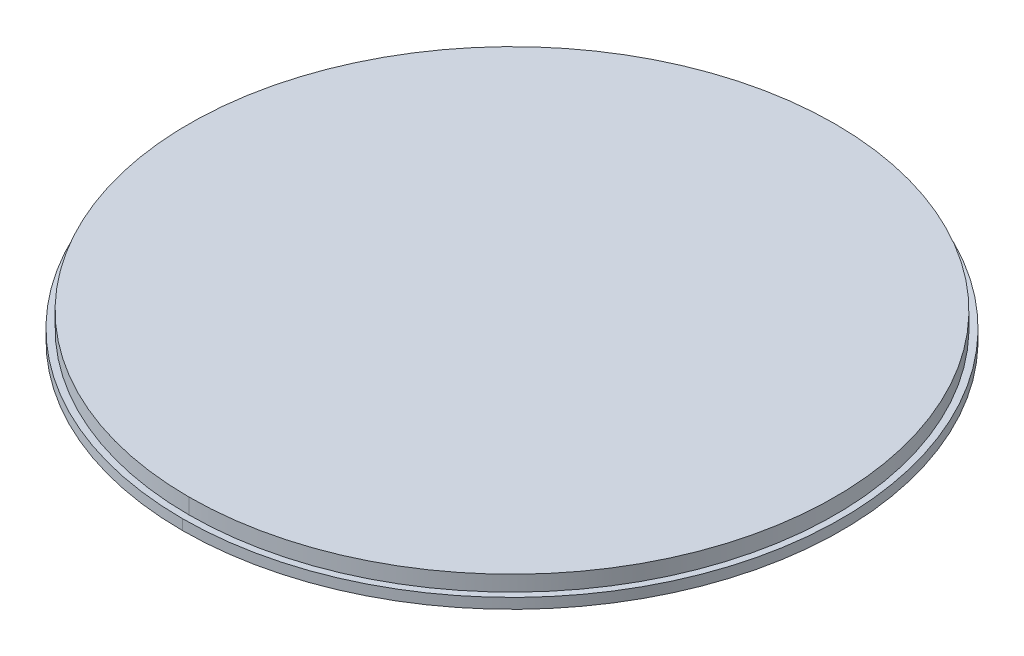
ISO-10303-21;
HEADER;
FILE_DESCRIPTION(('STEP AP214'),'2;1');
FILE_NAME('part.step','',(''),(''),'','','');
FILE_SCHEMA(('AUTOMOTIVE_DESIGN { 1 0 10303 214 1 1 1 1 }'));
ENDSEC;
DATA;
#1=APPLICATION_CONTEXT('core data for automotive mechanical design processes');
#2=APPLICATION_PROTOCOL_DEFINITION('international standard','automotive_design',2000,#1);
#3=PRODUCT_CONTEXT('',#1,'mechanical');
#4=PRODUCT('Part','Part','',(#3));
#5=PRODUCT_RELATED_PRODUCT_CATEGORY('part','',(#4));
#6=PRODUCT_DEFINITION_FORMATION('','',#4);
#7=PRODUCT_DEFINITION_CONTEXT('part definition',#1,'design');
#8=PRODUCT_DEFINITION('design','',#6,#7);
#9=PRODUCT_DEFINITION_SHAPE('','',#8);
#10=(LENGTH_UNIT() NAMED_UNIT(*) SI_UNIT(.MILLI.,.METRE.));
#11=(NAMED_UNIT(*) PLANE_ANGLE_UNIT() SI_UNIT($,.RADIAN.));
#12=(NAMED_UNIT(*) SI_UNIT($,.STERADIAN.) SOLID_ANGLE_UNIT());
#13=UNCERTAINTY_MEASURE_WITH_UNIT(LENGTH_MEASURE(1.E-05),#10,'distance_accuracy_value','');
#14=(GEOMETRIC_REPRESENTATION_CONTEXT(3) GLOBAL_UNCERTAINTY_ASSIGNED_CONTEXT((#13)) GLOBAL_UNIT_ASSIGNED_CONTEXT((#10,
#11,#12)) REPRESENTATION_CONTEXT('',''));
#15=CARTESIAN_POINT('',(0.,0.,0.));
#16=DIRECTION('',(0.,0.,1.));
#17=DIRECTION('',(1.,0.,0.));
#18=AXIS2_PLACEMENT_3D('',#15,#16,#17);
#19=CARTESIAN_POINT('',(0.,20.,0.));
#20=DIRECTION('',(0.,-1.,0.));
#21=DIRECTION('',(0.,0.,-1.));
#22=AXIS2_PLACEMENT_3D('',#19,#20,#21);
#23=CYLINDRICAL_SURFACE('',#22,250.);
#24=CARTESIAN_POINT('',(0.,20.,0.));
#25=DIRECTION('',(0.,1.,0.));
#26=DIRECTION('',(0.,0.,1.));
#27=AXIS2_PLACEMENT_3D('',#24,#25,#26);
#28=CIRCLE('',#27,250.);
#29=CARTESIAN_POINT('',(0.,20.,250.));
#30=VERTEX_POINT('',#29);
#31=CARTESIAN_POINT('',(0.,20.,-250.));
#32=VERTEX_POINT('',#31);
#33=EDGE_CURVE('E40',#30,#32,#28,.T.);
#34=ORIENTED_EDGE('',*,*,#33,.F.);
#35=DIRECTION('',(0.,-1.,0.));
#36=VECTOR('',#35,1.);
#37=CARTESIAN_POINT('',(0.,20.,250.));
#38=LINE('',#37,#36);
#39=CARTESIAN_POINT('',(0.,8.,250.));
#40=VERTEX_POINT('',#39);
#41=EDGE_CURVE('E11',#30,#40,#38,.T.);
#42=ORIENTED_EDGE('',*,*,#41,.T.);
#43=CARTESIAN_POINT('',(0.,8.,0.));
#44=DIRECTION('',(0.,1.,0.));
#45=DIRECTION('',(0.,0.,1.));
#46=AXIS2_PLACEMENT_3D('',#43,#44,#45);
#47=CIRCLE('',#46,250.);
#48=CARTESIAN_POINT('',(0.,8.,-250.));
#49=VERTEX_POINT('',#48);
#50=EDGE_CURVE('E27',#40,#49,#47,.T.);
#51=ORIENTED_EDGE('',*,*,#50,.T.);
#52=DIRECTION('',(0.,-1.,0.));
#53=VECTOR('',#52,1.);
#54=CARTESIAN_POINT('',(0.,20.,-250.));
#55=LINE('',#54,#53);
#56=EDGE_CURVE('E67',#32,#49,#55,.T.);
#57=ORIENTED_EDGE('',*,*,#56,.F.);
#58=EDGE_LOOP('',(#34,#42,#51,#57));
#59=FACE_BOUND('',#58,.T.);
#60=ADVANCED_FACE('F16',(#59),#23,.T.);
#61=CARTESIAN_POINT('',(0.,8.,0.));
#62=DIRECTION('',(0.,-1.,0.));
#63=DIRECTION('',(0.,0.,-1.));
#64=AXIS2_PLACEMENT_3D('',#61,#62,#63);
#65=CYLINDRICAL_SURFACE('',#64,255.);
#66=CARTESIAN_POINT('',(0.,8.,0.));
#67=DIRECTION('',(0.,1.,0.));
#68=DIRECTION('',(0.,0.,1.));
#69=AXIS2_PLACEMENT_3D('',#66,#67,#68);
#70=CIRCLE('',#69,255.);
#71=CARTESIAN_POINT('',(0.,8.,255.));
#72=VERTEX_POINT('',#71);
#73=CARTESIAN_POINT('',(0.,8.,-255.));
#74=VERTEX_POINT('',#73);
#75=EDGE_CURVE('E74',#72,#74,#70,.T.);
#76=ORIENTED_EDGE('',*,*,#75,.F.);
#77=DIRECTION('',(0.,-1.,0.));
#78=VECTOR('',#77,1.);
#79=CARTESIAN_POINT('',(0.,8.,255.));
#80=LINE('',#79,#78);
#81=CARTESIAN_POINT('',(0.,0.,255.));
#82=VERTEX_POINT('',#81);
#83=EDGE_CURVE('E78',#72,#82,#80,.T.);
#84=ORIENTED_EDGE('',*,*,#83,.T.);
#85=CARTESIAN_POINT('',(0.,0.,0.));
#86=DIRECTION('',(0.,1.,0.));
#87=DIRECTION('',(0.,0.,1.));
#88=AXIS2_PLACEMENT_3D('',#85,#86,#87);
#89=CIRCLE('',#88,255.);
#90=CARTESIAN_POINT('',(0.,0.,-255.));
#91=VERTEX_POINT('',#90);
#92=EDGE_CURVE('E95',#82,#91,#89,.T.);
#93=ORIENTED_EDGE('',*,*,#92,.T.);
#94=DIRECTION('',(0.,-1.,0.));
#95=VECTOR('',#94,1.);
#96=CARTESIAN_POINT('',(0.,8.,-255.));
#97=LINE('',#96,#95);
#98=EDGE_CURVE('E96',#74,#91,#97,.T.);
#99=ORIENTED_EDGE('',*,*,#98,.F.);
#100=EDGE_LOOP('',(#76,#84,#93,#99));
#101=FACE_BOUND('',#100,.T.);
#102=ADVANCED_FACE('F106',(#101),#65,.T.);
#103=CARTESIAN_POINT('',(0.,8.,0.));
#104=DIRECTION('',(0.,-1.,0.));
#105=DIRECTION('',(0.,0.,-1.));
#106=AXIS2_PLACEMENT_3D('',#103,#104,#105);
#107=CYLINDRICAL_SURFACE('',#106,255.);
#108=ORIENTED_EDGE('',*,*,#83,.F.);
#109=CARTESIAN_POINT('',(0.,8.,0.));
#110=DIRECTION('',(0.,1.,0.));
#111=DIRECTION('',(0.,0.,1.));
#112=AXIS2_PLACEMENT_3D('',#109,#110,#111);
#113=CIRCLE('',#112,255.);
#114=EDGE_CURVE('E89',#74,#72,#113,.T.);
#115=ORIENTED_EDGE('',*,*,#114,.F.);
#116=ORIENTED_EDGE('',*,*,#98,.T.);
#117=CARTESIAN_POINT('',(0.,0.,0.));
#118=DIRECTION('',(0.,1.,0.));
#119=DIRECTION('',(0.,0.,1.));
#120=AXIS2_PLACEMENT_3D('',#117,#118,#119);
#121=CIRCLE('',#120,255.);
#122=EDGE_CURVE('E20',#91,#82,#121,.T.);
#123=ORIENTED_EDGE('',*,*,#122,.T.);
#124=EDGE_LOOP('',(#108,#115,#116,#123));
#125=FACE_BOUND('',#124,.T.);
#126=ADVANCED_FACE('F145',(#125),#107,.T.);
#127=CARTESIAN_POINT('',(0.,8.,0.));
#128=DIRECTION('',(0.,1.,0.));
#129=DIRECTION('',(1.,0.,0.));
#130=AXIS2_PLACEMENT_3D('',#127,#128,#129);
#131=PLANE('',#130);
#132=ORIENTED_EDGE('',*,*,#114,.T.);
#133=ORIENTED_EDGE('',*,*,#75,.T.);
#134=EDGE_LOOP('',(#132,#133));
#135=FACE_BOUND('',#134,.T.);
#136=CARTESIAN_POINT('',(0.,8.,0.));
#137=DIRECTION('',(0.,1.,0.));
#138=DIRECTION('',(0.,0.,1.));
#139=AXIS2_PLACEMENT_3D('',#136,#137,#138);
#140=CIRCLE('',#139,250.);
#141=EDGE_CURVE('E70',#49,#40,#140,.T.);
#142=ORIENTED_EDGE('',*,*,#141,.F.);
#143=ORIENTED_EDGE('',*,*,#50,.F.);
#144=EDGE_LOOP('',(#142,#143));
#145=FACE_BOUND('',#144,.T.);
#146=ADVANCED_FACE('F80',(#135,#145),#131,.T.);
#147=CARTESIAN_POINT('',(0.,0.,0.));
#148=DIRECTION('',(0.,1.,0.));
#149=DIRECTION('',(1.,0.,0.));
#150=AXIS2_PLACEMENT_3D('',#147,#148,#149);
#151=PLANE('',#150);
#152=ORIENTED_EDGE('',*,*,#122,.F.);
#153=ORIENTED_EDGE('',*,*,#92,.F.);
#154=EDGE_LOOP('',(#152,#153));
#155=FACE_BOUND('',#154,.T.);
#156=ADVANCED_FACE('F111',(#155),#151,.F.);
#157=CARTESIAN_POINT('',(0.,20.,0.));
#158=DIRECTION('',(0.,-1.,0.));
#159=DIRECTION('',(0.,0.,-1.));
#160=AXIS2_PLACEMENT_3D('',#157,#158,#159);
#161=CYLINDRICAL_SURFACE('',#160,250.);
#162=ORIENTED_EDGE('',*,*,#41,.F.);
#163=CARTESIAN_POINT('',(0.,20.,0.));
#164=DIRECTION('',(0.,1.,0.));
#165=DIRECTION('',(0.,0.,1.));
#166=AXIS2_PLACEMENT_3D('',#163,#164,#165);
#167=CIRCLE('',#166,250.);
#168=EDGE_CURVE('E72',#32,#30,#167,.T.);
#169=ORIENTED_EDGE('',*,*,#168,.F.);
#170=ORIENTED_EDGE('',*,*,#56,.T.);
#171=ORIENTED_EDGE('',*,*,#141,.T.);
#172=EDGE_LOOP('',(#162,#169,#170,#171));
#173=FACE_BOUND('',#172,.T.);
#174=ADVANCED_FACE('F18',(#173),#161,.T.);
#175=CARTESIAN_POINT('',(0.,20.,0.));
#176=DIRECTION('',(0.,1.,0.));
#177=DIRECTION('',(1.,0.,0.));
#178=AXIS2_PLACEMENT_3D('',#175,#176,#177);
#179=PLANE('',#178);
#180=ORIENTED_EDGE('',*,*,#168,.T.);
#181=ORIENTED_EDGE('',*,*,#33,.T.);
#182=EDGE_LOOP('',(#180,#181));
#183=FACE_BOUND('',#182,.T.);
#184=ADVANCED_FACE('F130',(#183),#179,.T.);
#185=CLOSED_SHELL('',(#60,#102,#126,#146,#156,#174,#184));
#186=MANIFOLD_SOLID_BREP('B1',#185);
#187=ADVANCED_BREP_SHAPE_REPRESENTATION('',(#18,#186),#14);
#188=SHAPE_DEFINITION_REPRESENTATION(#9,#187);
ENDSEC;
END-ISO-10303-21;
